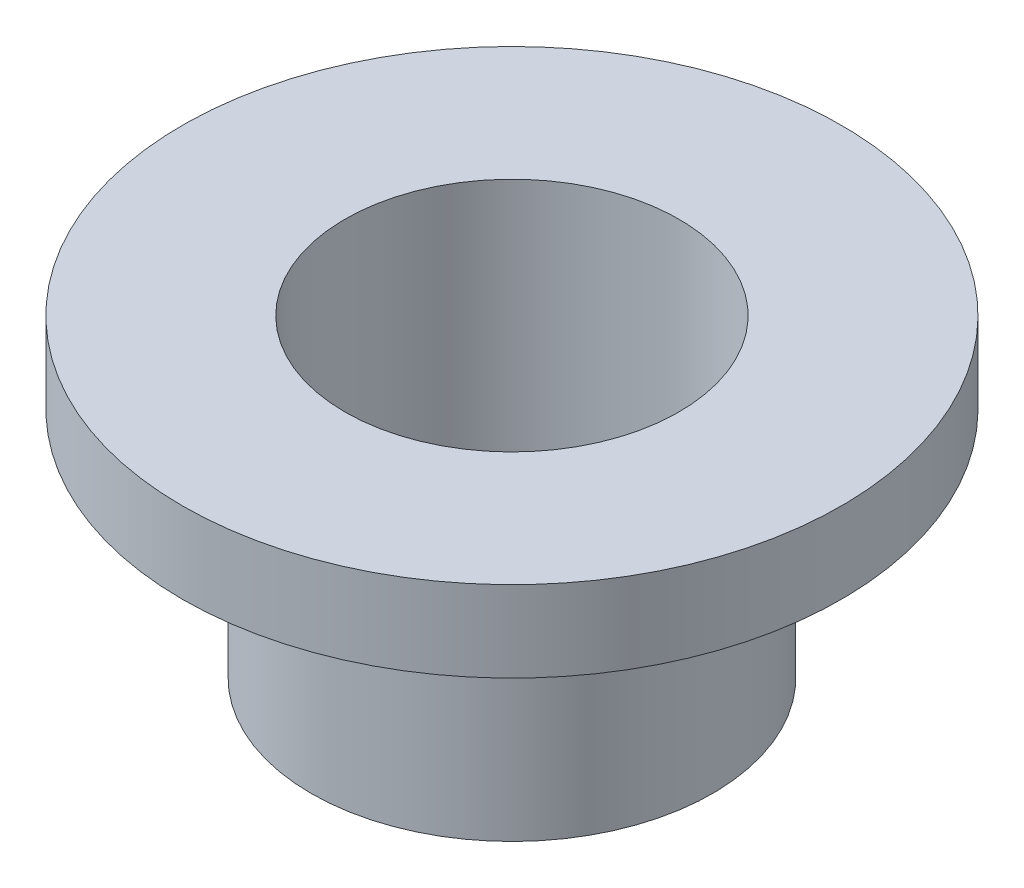
ISO-10303-21;
HEADER;
FILE_DESCRIPTION(('STEP AP214'),'2;1');
FILE_NAME('part.step','',(''),(''),'','','');
FILE_SCHEMA(('AUTOMOTIVE_DESIGN { 1 0 10303 214 1 1 1 1 }'));
ENDSEC;
DATA;
#1=APPLICATION_CONTEXT('core data for automotive mechanical design processes');
#2=APPLICATION_PROTOCOL_DEFINITION('international standard','automotive_design',2000,#1);
#3=PRODUCT_CONTEXT('',#1,'mechanical');
#4=PRODUCT('Part','Part','',(#3));
#5=PRODUCT_RELATED_PRODUCT_CATEGORY('part','',(#4));
#6=PRODUCT_DEFINITION_FORMATION('','',#4);
#7=PRODUCT_DEFINITION_CONTEXT('part definition',#1,'design');
#8=PRODUCT_DEFINITION('design','',#6,#7);
#9=PRODUCT_DEFINITION_SHAPE('','',#8);
#10=(LENGTH_UNIT() NAMED_UNIT(*) SI_UNIT(.MILLI.,.METRE.));
#11=(NAMED_UNIT(*) PLANE_ANGLE_UNIT() SI_UNIT($,.RADIAN.));
#12=(NAMED_UNIT(*) SI_UNIT($,.STERADIAN.) SOLID_ANGLE_UNIT());
#13=UNCERTAINTY_MEASURE_WITH_UNIT(LENGTH_MEASURE(1.E-05),#10,'distance_accuracy_value','');
#14=(GEOMETRIC_REPRESENTATION_CONTEXT(3) GLOBAL_UNCERTAINTY_ASSIGNED_CONTEXT((#13)) GLOBAL_UNIT_ASSIGNED_CONTEXT((#10,
#11,#12)) REPRESENTATION_CONTEXT('',''));
#15=CARTESIAN_POINT('',(0.,0.,0.));
#16=DIRECTION('',(0.,0.,1.));
#17=DIRECTION('',(1.,0.,0.));
#18=AXIS2_PLACEMENT_3D('',#15,#16,#17);
#19=CARTESIAN_POINT('',(3.96875,0.,0.));
#20=DIRECTION('',(0.,1.,0.));
#21=DIRECTION('',(0.,0.,1.));
#22=AXIS2_PLACEMENT_3D('',#19,#20,#21);
#23=PLANE('',#22);
#24=CARTESIAN_POINT('',(0.,0.,0.));
#25=DIRECTION('',(0.,1.,0.));
#26=DIRECTION('',(0.,0.,1.));
#27=AXIS2_PLACEMENT_3D('',#24,#25,#26);
#28=CIRCLE('',#27,3.96875);
#29=CARTESIAN_POINT('',(0.,0.,3.96875));
#30=VERTEX_POINT('',#29);
#31=EDGE_CURVE('E10',#30,#30,#28,.T.);
#32=ORIENTED_EDGE('',*,*,#31,.F.);
#33=EDGE_LOOP('',(#32));
#34=FACE_BOUND('',#33,.T.);
#35=CARTESIAN_POINT('',(0.,0.,0.));
#36=DIRECTION('',(0.,1.,0.));
#37=DIRECTION('',(0.,0.,1.));
#38=AXIS2_PLACEMENT_3D('',#35,#36,#37);
#39=CIRCLE('',#38,3.302);
#40=CARTESIAN_POINT('',(0.,0.,3.302));
#41=VERTEX_POINT('',#40);
#42=EDGE_CURVE('E380',#41,#41,#39,.T.);
#43=ORIENTED_EDGE('',*,*,#42,.T.);
#44=EDGE_LOOP('',(#43));
#45=FACE_BOUND('',#44,.T.);
#46=ADVANCED_FACE('F358',(#34,#45),#23,.F.);
#47=CARTESIAN_POINT('',(0.,29.1833441208198,0.));
#48=DIRECTION('',(0.,1.,0.));
#49=DIRECTION('',(0.,0.,1.));
#50=AXIS2_PLACEMENT_3D('',#47,#48,#49);
#51=CYLINDRICAL_SURFACE('',#50,3.96875);
#52=CARTESIAN_POINT('',(0.,4.5974,0.));
#53=DIRECTION('',(0.,1.,0.));
#54=DIRECTION('',(0.,0.,1.));
#55=AXIS2_PLACEMENT_3D('',#52,#53,#54);
#56=CIRCLE('',#55,3.96875);
#57=CARTESIAN_POINT('',(0.,4.5974,3.96875));
#58=VERTEX_POINT('',#57);
#59=EDGE_CURVE('E364',#58,#58,#56,.T.);
#60=ORIENTED_EDGE('',*,*,#59,.F.);
#61=EDGE_LOOP('',(#60));
#62=FACE_BOUND('',#61,.T.);
#63=ORIENTED_EDGE('',*,*,#31,.T.);
#64=EDGE_LOOP('',(#63));
#65=FACE_BOUND('',#64,.T.);
#66=ADVANCED_FACE('F405',(#62,#65),#51,.T.);
#67=CARTESIAN_POINT('',(6.5151,4.5974,0.));
#68=DIRECTION('',(0.,1.,0.));
#69=DIRECTION('',(0.,0.,1.));
#70=AXIS2_PLACEMENT_3D('',#67,#68,#69);
#71=PLANE('',#70);
#72=CARTESIAN_POINT('',(0.,4.5974,0.));
#73=DIRECTION('',(0.,1.,0.));
#74=DIRECTION('',(0.,0.,1.));
#75=AXIS2_PLACEMENT_3D('',#72,#73,#74);
#76=CIRCLE('',#75,6.5151);
#77=CARTESIAN_POINT('',(0.,4.5974,6.5151));
#78=VERTEX_POINT('',#77);
#79=EDGE_CURVE('E368',#78,#78,#76,.T.);
#80=ORIENTED_EDGE('',*,*,#79,.F.);
#81=EDGE_LOOP('',(#80));
#82=FACE_BOUND('',#81,.T.);
#83=ORIENTED_EDGE('',*,*,#59,.T.);
#84=EDGE_LOOP('',(#83));
#85=FACE_BOUND('',#84,.T.);
#86=ADVANCED_FACE('F400',(#82,#85),#71,.F.);
#87=CARTESIAN_POINT('',(0.,29.1833441208198,0.));
#88=DIRECTION('',(0.,1.,0.));
#89=DIRECTION('',(0.,0.,1.));
#90=AXIS2_PLACEMENT_3D('',#87,#88,#89);
#91=CYLINDRICAL_SURFACE('',#90,6.5151);
#92=CARTESIAN_POINT('',(0.,6.1976,0.));
#93=DIRECTION('',(0.,1.,0.));
#94=DIRECTION('',(0.,0.,1.));
#95=AXIS2_PLACEMENT_3D('',#92,#93,#94);
#96=CIRCLE('',#95,6.5151);
#97=CARTESIAN_POINT('',(0.,6.1976,6.5151));
#98=VERTEX_POINT('',#97);
#99=EDGE_CURVE('E372',#98,#98,#96,.T.);
#100=ORIENTED_EDGE('',*,*,#99,.F.);
#101=EDGE_LOOP('',(#100));
#102=FACE_BOUND('',#101,.T.);
#103=ORIENTED_EDGE('',*,*,#79,.T.);
#104=EDGE_LOOP('',(#103));
#105=FACE_BOUND('',#104,.T.);
#106=ADVANCED_FACE('F394',(#102,#105),#91,.T.);
#107=CARTESIAN_POINT('',(3.302,6.1976,0.));
#108=DIRECTION('',(0.,-1.,0.));
#109=DIRECTION('',(0.,0.,-1.));
#110=AXIS2_PLACEMENT_3D('',#107,#108,#109);
#111=PLANE('',#110);
#112=CARTESIAN_POINT('',(0.,6.1976,0.));
#113=DIRECTION('',(0.,1.,0.));
#114=DIRECTION('',(0.,0.,1.));
#115=AXIS2_PLACEMENT_3D('',#112,#113,#114);
#116=CIRCLE('',#115,3.302);
#117=CARTESIAN_POINT('',(0.,6.1976,3.302));
#118=VERTEX_POINT('',#117);
#119=EDGE_CURVE('E377',#118,#118,#116,.T.);
#120=ORIENTED_EDGE('',*,*,#119,.F.);
#121=EDGE_LOOP('',(#120));
#122=FACE_BOUND('',#121,.T.);
#123=ORIENTED_EDGE('',*,*,#99,.T.);
#124=EDGE_LOOP('',(#123));
#125=FACE_BOUND('',#124,.T.);
#126=ADVANCED_FACE('F388',(#122,#125),#111,.F.);
#127=CARTESIAN_POINT('',(0.,29.1833441208198,0.));
#128=DIRECTION('',(0.,1.,0.));
#129=DIRECTION('',(0.,0.,1.));
#130=AXIS2_PLACEMENT_3D('',#127,#128,#129);
#131=CYLINDRICAL_SURFACE('',#130,3.302);
#132=ORIENTED_EDGE('',*,*,#42,.F.);
#133=EDGE_LOOP('',(#132));
#134=FACE_BOUND('',#133,.T.);
#135=ORIENTED_EDGE('',*,*,#119,.T.);
#136=EDGE_LOOP('',(#135));
#137=FACE_BOUND('',#136,.T.);
#138=ADVANCED_FACE('F385',(#134,#137),#131,.F.);
#139=CLOSED_SHELL('',(#46,#66,#86,#106,#126,#138));
#140=MANIFOLD_SOLID_BREP('B2',#139);
#141=ADVANCED_BREP_SHAPE_REPRESENTATION('',(#18,#140),#14);
#142=SHAPE_DEFINITION_REPRESENTATION(#9,#141);
ENDSEC;
END-ISO-10303-21;
